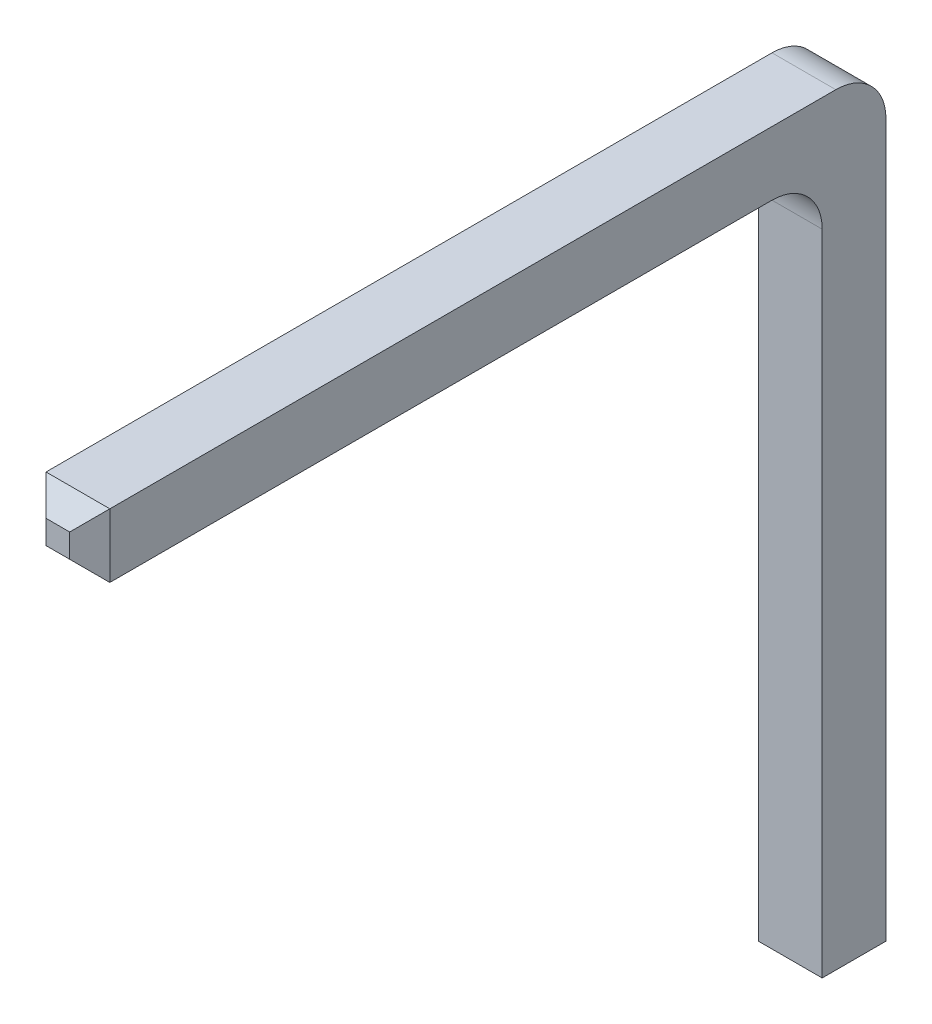
ISO-10303-21;
HEADER;
FILE_DESCRIPTION(('STEP AP214'),'2;1');
FILE_NAME('part.step','',(''),(''),'','','');
FILE_SCHEMA(('AUTOMOTIVE_DESIGN { 1 0 10303 214 1 1 1 1 }'));
ENDSEC;
DATA;
#1=APPLICATION_CONTEXT('core data for automotive mechanical design processes');
#2=APPLICATION_PROTOCOL_DEFINITION('international standard','automotive_design',2000,#1);
#3=PRODUCT_CONTEXT('',#1,'mechanical');
#4=PRODUCT('Part','Part','',(#3));
#5=PRODUCT_RELATED_PRODUCT_CATEGORY('part','',(#4));
#6=PRODUCT_DEFINITION_FORMATION('','',#4);
#7=PRODUCT_DEFINITION_CONTEXT('part definition',#1,'design');
#8=PRODUCT_DEFINITION('design','',#6,#7);
#9=PRODUCT_DEFINITION_SHAPE('','',#8);
#10=(LENGTH_UNIT() NAMED_UNIT(*) SI_UNIT(.MILLI.,.METRE.));
#11=(NAMED_UNIT(*) PLANE_ANGLE_UNIT() SI_UNIT($,.RADIAN.));
#12=(NAMED_UNIT(*) SI_UNIT($,.STERADIAN.) SOLID_ANGLE_UNIT());
#13=UNCERTAINTY_MEASURE_WITH_UNIT(LENGTH_MEASURE(1.E-05),#10,'distance_accuracy_value','');
#14=(GEOMETRIC_REPRESENTATION_CONTEXT(3) GLOBAL_UNCERTAINTY_ASSIGNED_CONTEXT((#13)) GLOBAL_UNIT_ASSIGNED_CONTEXT((#10,
#11,#12)) REPRESENTATION_CONTEXT('',''));
#15=CARTESIAN_POINT('',(0.,0.,0.));
#16=DIRECTION('',(0.,0.,1.));
#17=DIRECTION('',(1.,0.,0.));
#18=AXIS2_PLACEMENT_3D('',#15,#16,#17);
#19=CARTESIAN_POINT('',(0.,7.8,0.636));
#20=DIRECTION('',(0.,0.,-1.));
#21=DIRECTION('',(-1.,0.,0.));
#22=AXIS2_PLACEMENT_3D('',#19,#20,#21);
#23=PLANE('',#22);
#24=DIRECTION('',(0.,-1.,0.));
#25=VECTOR('',#24,1.);
#26=CARTESIAN_POINT('',(0.,7.8,0.636));
#27=LINE('',#26,#25);
#28=CARTESIAN_POINT('',(0.,6.664,0.636));
#29=VERTEX_POINT('',#28);
#30=CARTESIAN_POINT('',(0.,0.200000000000001,0.636));
#31=VERTEX_POINT('',#30);
#32=EDGE_CURVE('E152',#29,#31,#27,.T.);
#33=ORIENTED_EDGE('',*,*,#32,.T.);
#34=DIRECTION('',(1.,0.,0.));
#35=VECTOR('',#34,1.);
#36=CARTESIAN_POINT('',(0.,0.200000000000001,0.636));
#37=LINE('',#36,#35);
#38=CARTESIAN_POINT('',(0.636,0.200000000000001,0.636));
#39=VERTEX_POINT('',#38);
#40=EDGE_CURVE('E11',#31,#39,#37,.T.);
#41=ORIENTED_EDGE('',*,*,#40,.T.);
#42=DIRECTION('',(0.,-1.,0.));
#43=VECTOR('',#42,1.);
#44=CARTESIAN_POINT('',(0.636,7.8,0.636));
#45=LINE('',#44,#43);
#46=CARTESIAN_POINT('',(0.636,6.664,0.636));
#47=VERTEX_POINT('',#46);
#48=EDGE_CURVE('E156',#47,#39,#45,.T.);
#49=ORIENTED_EDGE('',*,*,#48,.F.);
#50=DIRECTION('',(1.,0.,0.));
#51=VECTOR('',#50,1.);
#52=CARTESIAN_POINT('',(0.,6.664,0.636));
#53=LINE('',#52,#51);
#54=EDGE_CURVE('E145',#47,#29,#53,.F.);
#55=ORIENTED_EDGE('',*,*,#54,.T.);
#56=EDGE_LOOP('',(#33,#41,#49,#55));
#57=FACE_BOUND('',#56,.T.);
#58=ADVANCED_FACE('F37',(#57),#23,.F.);
#59=CARTESIAN_POINT('',(0.,7.8,0.));
#60=DIRECTION('',(1.,0.,0.));
#61=DIRECTION('',(0.,0.,-1.));
#62=AXIS2_PLACEMENT_3D('',#59,#60,#61);
#63=PLANE('',#62);
#64=DIRECTION('',(0.,-1.,0.));
#65=VECTOR('',#64,1.);
#66=CARTESIAN_POINT('',(0.,7.8,0.));
#67=LINE('',#66,#65);
#68=CARTESIAN_POINT('',(0.,7.3,0.));
#69=VERTEX_POINT('',#68);
#70=CARTESIAN_POINT('',(0.,0.200000000000001,0.));
#71=VERTEX_POINT('',#70);
#72=EDGE_CURVE('E235',#69,#71,#67,.T.);
#73=ORIENTED_EDGE('',*,*,#72,.T.);
#74=DIRECTION('',(0.,0.,1.));
#75=VECTOR('',#74,1.);
#76=CARTESIAN_POINT('',(0.,0.200000000000001,0.));
#77=LINE('',#76,#75);
#78=EDGE_CURVE('E181',#71,#31,#77,.T.);
#79=ORIENTED_EDGE('',*,*,#78,.T.);
#80=ORIENTED_EDGE('',*,*,#32,.F.);
#81=CARTESIAN_POINT('',(0.,6.664,1.136));
#82=DIRECTION('',(1.,0.,0.));
#83=DIRECTION('',(0.,0.,-1.));
#84=AXIS2_PLACEMENT_3D('',#81,#82,#83);
#85=CIRCLE('',#84,0.5);
#86=CARTESIAN_POINT('',(0.,7.164,1.136));
#87=VERTEX_POINT('',#86);
#88=EDGE_CURVE('E146',#29,#87,#85,.T.);
#89=ORIENTED_EDGE('',*,*,#88,.T.);
#90=DIRECTION('',(0.,0.,-1.));
#91=VECTOR('',#90,1.);
#92=CARTESIAN_POINT('',(0.,7.164,7.936));
#93=LINE('',#92,#91);
#94=CARTESIAN_POINT('',(0.,7.164,7.736));
#95=VERTEX_POINT('',#94);
#96=EDGE_CURVE('E136',#95,#87,#93,.T.);
#97=ORIENTED_EDGE('',*,*,#96,.F.);
#98=DIRECTION('',(0.,1.,0.));
#99=VECTOR('',#98,1.);
#100=CARTESIAN_POINT('',(0.,7.8,7.736));
#101=LINE('',#100,#99);
#102=CARTESIAN_POINT('',(0.,7.8,7.736));
#103=VERTEX_POINT('',#102);
#104=EDGE_CURVE('E175',#95,#103,#101,.T.);
#105=ORIENTED_EDGE('',*,*,#104,.T.);
#106=DIRECTION('',(0.,0.,1.));
#107=VECTOR('',#106,1.);
#108=CARTESIAN_POINT('',(0.,7.8,0.));
#109=LINE('',#108,#107);
#110=CARTESIAN_POINT('',(0.,7.8,0.5));
#111=VERTEX_POINT('',#110);
#112=EDGE_CURVE('E177',#111,#103,#109,.T.);
#113=ORIENTED_EDGE('',*,*,#112,.F.);
#114=CARTESIAN_POINT('',(0.,7.3,0.5));
#115=DIRECTION('',(1.,0.,0.));
#116=DIRECTION('',(0.,0.,-1.));
#117=AXIS2_PLACEMENT_3D('',#114,#115,#116);
#118=CIRCLE('',#117,0.5);
#119=EDGE_CURVE('E435',#111,#69,#118,.F.);
#120=ORIENTED_EDGE('',*,*,#119,.T.);
#121=EDGE_LOOP('',(#73,#79,#80,#89,#97,#105,#113,#120));
#122=FACE_BOUND('',#121,.T.);
#123=ADVANCED_FACE('F233',(#122),#63,.F.);
#124=CARTESIAN_POINT('',(0.636,7.8,0.));
#125=DIRECTION('',(-1.,0.,0.));
#126=DIRECTION('',(0.,0.,1.));
#127=AXIS2_PLACEMENT_3D('',#124,#125,#126);
#128=PLANE('',#127);
#129=ORIENTED_EDGE('',*,*,#48,.T.);
#130=DIRECTION('',(0.,0.,-1.));
#131=VECTOR('',#130,1.);
#132=CARTESIAN_POINT('',(0.636,0.200000000000001,0.));
#133=LINE('',#132,#131);
#134=CARTESIAN_POINT('',(0.636,0.200000000000001,0.));
#135=VERTEX_POINT('',#134);
#136=EDGE_CURVE('E46',#39,#135,#133,.T.);
#137=ORIENTED_EDGE('',*,*,#136,.T.);
#138=DIRECTION('',(0.,-1.,0.));
#139=VECTOR('',#138,1.);
#140=CARTESIAN_POINT('',(0.636,7.8,0.));
#141=LINE('',#140,#139);
#142=CARTESIAN_POINT('',(0.636,7.3,0.));
#143=VERTEX_POINT('',#142);
#144=EDGE_CURVE('E236',#143,#135,#141,.T.);
#145=ORIENTED_EDGE('',*,*,#144,.F.);
#146=CARTESIAN_POINT('',(0.636,7.3,0.5));
#147=DIRECTION('',(-1.,0.,0.));
#148=DIRECTION('',(0.,0.,1.));
#149=AXIS2_PLACEMENT_3D('',#146,#147,#148);
#150=CIRCLE('',#149,0.5);
#151=CARTESIAN_POINT('',(0.636,7.8,0.5));
#152=VERTEX_POINT('',#151);
#153=EDGE_CURVE('E147',#143,#152,#150,.F.);
#154=ORIENTED_EDGE('',*,*,#153,.T.);
#155=DIRECTION('',(0.,0.,-1.));
#156=VECTOR('',#155,1.);
#157=CARTESIAN_POINT('',(0.636,7.8,0.));
#158=LINE('',#157,#156);
#159=CARTESIAN_POINT('',(0.636000000000001,7.8,7.736));
#160=VERTEX_POINT('',#159);
#161=EDGE_CURVE('E238',#160,#152,#158,.T.);
#162=ORIENTED_EDGE('',*,*,#161,.F.);
#163=DIRECTION('',(0.,-1.,0.));
#164=VECTOR('',#163,1.);
#165=CARTESIAN_POINT('',(0.636000000000001,7.164,7.736));
#166=LINE('',#165,#164);
#167=CARTESIAN_POINT('',(0.636,7.164,7.736));
#168=VERTEX_POINT('',#167);
#169=EDGE_CURVE('E133',#160,#168,#166,.T.);
#170=ORIENTED_EDGE('',*,*,#169,.T.);
#171=DIRECTION('',(0.,0.,-1.));
#172=VECTOR('',#171,1.);
#173=CARTESIAN_POINT('',(0.636,7.164,7.936));
#174=LINE('',#173,#172);
#175=CARTESIAN_POINT('',(0.636,7.164,1.136));
#176=VERTEX_POINT('',#175);
#177=EDGE_CURVE('E127',#168,#176,#174,.T.);
#178=ORIENTED_EDGE('',*,*,#177,.T.);
#179=CARTESIAN_POINT('',(0.636,6.664,1.136));
#180=DIRECTION('',(-1.,0.,0.));
#181=DIRECTION('',(0.,0.,1.));
#182=AXIS2_PLACEMENT_3D('',#179,#180,#181);
#183=CIRCLE('',#182,0.5);
#184=EDGE_CURVE('E130',#176,#47,#183,.T.);
#185=ORIENTED_EDGE('',*,*,#184,.T.);
#186=EDGE_LOOP('',(#129,#137,#145,#154,#162,#170,#178,#185));
#187=FACE_BOUND('',#186,.T.);
#188=ADVANCED_FACE('F129',(#187),#128,.F.);
#189=CARTESIAN_POINT('',(0.,7.8,0.));
#190=DIRECTION('',(0.,0.,1.));
#191=DIRECTION('',(1.,0.,0.));
#192=AXIS2_PLACEMENT_3D('',#189,#190,#191);
#193=PLANE('',#192);
#194=ORIENTED_EDGE('',*,*,#144,.T.);
#195=DIRECTION('',(-1.,0.,0.));
#196=VECTOR('',#195,1.);
#197=CARTESIAN_POINT('',(0.,0.200000000000001,0.));
#198=LINE('',#197,#196);
#199=EDGE_CURVE('E202',#135,#71,#198,.T.);
#200=ORIENTED_EDGE('',*,*,#199,.T.);
#201=ORIENTED_EDGE('',*,*,#72,.F.);
#202=DIRECTION('',(-1.,0.,0.));
#203=VECTOR('',#202,1.);
#204=CARTESIAN_POINT('',(0.636,7.3,0.));
#205=LINE('',#204,#203);
#206=EDGE_CURVE('E434',#69,#143,#205,.F.);
#207=ORIENTED_EDGE('',*,*,#206,.T.);
#208=EDGE_LOOP('',(#194,#200,#201,#207));
#209=FACE_BOUND('',#208,.T.);
#210=ADVANCED_FACE('F388',(#209),#193,.F.);
#211=CARTESIAN_POINT('',(0.,7.8,0.));
#212=DIRECTION('',(0.,1.,0.));
#213=DIRECTION('',(0.,0.,1.));
#214=AXIS2_PLACEMENT_3D('',#211,#212,#213);
#215=PLANE('',#214);
#216=ORIENTED_EDGE('',*,*,#112,.T.);
#217=DIRECTION('',(1.,0.,0.));
#218=VECTOR('',#217,1.);
#219=CARTESIAN_POINT('',(0.,7.8,7.736));
#220=LINE('',#219,#218);
#221=EDGE_CURVE('E173',#103,#160,#220,.T.);
#222=ORIENTED_EDGE('',*,*,#221,.T.);
#223=ORIENTED_EDGE('',*,*,#161,.T.);
#224=DIRECTION('',(-1.,0.,0.));
#225=VECTOR('',#224,1.);
#226=CARTESIAN_POINT('',(0.,7.8,0.5));
#227=LINE('',#226,#225);
#228=EDGE_CURVE('E154',#152,#111,#227,.T.);
#229=ORIENTED_EDGE('',*,*,#228,.T.);
#230=EDGE_LOOP('',(#216,#222,#223,#229));
#231=FACE_BOUND('',#230,.T.);
#232=ADVANCED_FACE('F247',(#231),#215,.T.);
#233=CARTESIAN_POINT('',(0.,0.,0.));
#234=DIRECTION('',(0.,1.,0.));
#235=DIRECTION('',(0.,0.,1.));
#236=AXIS2_PLACEMENT_3D('',#233,#234,#235);
#237=PLANE('',#236);
#238=DIRECTION('',(-1.,0.,0.));
#239=VECTOR('',#238,1.);
#240=CARTESIAN_POINT('',(0.,0.,0.435999999999998));
#241=LINE('',#240,#239);
#242=CARTESIAN_POINT('',(0.435999999999998,0.,0.435999999999998));
#243=VERTEX_POINT('',#242);
#244=CARTESIAN_POINT('',(0.200000000000002,0.,0.435999999999998));
#245=VERTEX_POINT('',#244);
#246=EDGE_CURVE('E193',#243,#245,#241,.T.);
#247=ORIENTED_EDGE('',*,*,#246,.T.);
#248=DIRECTION('',(0.,0.,-1.));
#249=VECTOR('',#248,1.);
#250=CARTESIAN_POINT('',(0.200000000000002,0.,0.));
#251=LINE('',#250,#249);
#252=CARTESIAN_POINT('',(0.200000000000002,0.,0.200000000000002));
#253=VERTEX_POINT('',#252);
#254=EDGE_CURVE('E199',#245,#253,#251,.T.);
#255=ORIENTED_EDGE('',*,*,#254,.T.);
#256=DIRECTION('',(1.,0.,0.));
#257=VECTOR('',#256,1.);
#258=CARTESIAN_POINT('',(0.,0.,0.200000000000002));
#259=LINE('',#258,#257);
#260=CARTESIAN_POINT('',(0.435999999999998,0.,0.200000000000002));
#261=VERTEX_POINT('',#260);
#262=EDGE_CURVE('E197',#253,#261,#259,.T.);
#263=ORIENTED_EDGE('',*,*,#262,.T.);
#264=DIRECTION('',(0.,0.,1.));
#265=VECTOR('',#264,1.);
#266=CARTESIAN_POINT('',(0.435999999999998,0.,0.));
#267=LINE('',#266,#265);
#268=EDGE_CURVE('E195',#261,#243,#267,.T.);
#269=ORIENTED_EDGE('',*,*,#268,.T.);
#270=EDGE_LOOP('',(#247,#255,#263,#269));
#271=FACE_BOUND('',#270,.T.);
#272=ADVANCED_FACE('F223',(#271),#237,.F.);
#273=CARTESIAN_POINT('',(0.,7.164,7.936));
#274=DIRECTION('',(0.,1.,0.));
#275=DIRECTION('',(0.,0.,1.));
#276=AXIS2_PLACEMENT_3D('',#273,#274,#275);
#277=PLANE('',#276);
#278=ORIENTED_EDGE('',*,*,#177,.F.);
#279=DIRECTION('',(-1.,0.,0.));
#280=VECTOR('',#279,1.);
#281=CARTESIAN_POINT('',(0.,7.164,7.736));
#282=LINE('',#281,#280);
#283=EDGE_CURVE('E179',#168,#95,#282,.T.);
#284=ORIENTED_EDGE('',*,*,#283,.T.);
#285=ORIENTED_EDGE('',*,*,#96,.T.);
#286=DIRECTION('',(1.,0.,0.));
#287=VECTOR('',#286,1.);
#288=CARTESIAN_POINT('',(0.636,7.164,1.136));
#289=LINE('',#288,#287);
#290=EDGE_CURVE('E144',#87,#176,#289,.T.);
#291=ORIENTED_EDGE('',*,*,#290,.T.);
#292=EDGE_LOOP('',(#278,#284,#285,#291));
#293=FACE_BOUND('',#292,.T.);
#294=ADVANCED_FACE('F149',(#293),#277,.F.);
#295=CARTESIAN_POINT('',(0.,0.,7.936));
#296=DIRECTION('',(0.,0.,1.));
#297=DIRECTION('',(1.,0.,0.));
#298=AXIS2_PLACEMENT_3D('',#295,#296,#297);
#299=PLANE('',#298);
#300=DIRECTION('',(1.,0.,0.));
#301=VECTOR('',#300,1.);
#302=CARTESIAN_POINT('',(0.636,7.364,7.936));
#303=LINE('',#302,#301);
#304=CARTESIAN_POINT('',(0.200000000000001,7.364,7.936));
#305=VERTEX_POINT('',#304);
#306=CARTESIAN_POINT('',(0.436000000000001,7.364,7.936));
#307=VERTEX_POINT('',#306);
#308=EDGE_CURVE('E270',#305,#307,#303,.T.);
#309=ORIENTED_EDGE('',*,*,#308,.T.);
#310=DIRECTION('',(0.,1.,0.));
#311=VECTOR('',#310,1.);
#312=CARTESIAN_POINT('',(0.436000000000001,7.8,7.936));
#313=LINE('',#312,#311);
#314=CARTESIAN_POINT('',(0.436000000000001,7.6,7.936));
#315=VERTEX_POINT('',#314);
#316=EDGE_CURVE('E170',#307,#315,#313,.T.);
#317=ORIENTED_EDGE('',*,*,#316,.T.);
#318=DIRECTION('',(-1.,0.,0.));
#319=VECTOR('',#318,1.);
#320=CARTESIAN_POINT('',(0.,7.6,7.936));
#321=LINE('',#320,#319);
#322=CARTESIAN_POINT('',(0.200000000000001,7.6,7.936));
#323=VERTEX_POINT('',#322);
#324=EDGE_CURVE('E260',#315,#323,#321,.T.);
#325=ORIENTED_EDGE('',*,*,#324,.T.);
#326=DIRECTION('',(0.,-1.,0.));
#327=VECTOR('',#326,1.);
#328=CARTESIAN_POINT('',(0.200000000000001,7.164,7.936));
#329=LINE('',#328,#327);
#330=EDGE_CURVE('E255',#323,#305,#329,.T.);
#331=ORIENTED_EDGE('',*,*,#330,.T.);
#332=EDGE_LOOP('',(#309,#317,#325,#331));
#333=FACE_BOUND('',#332,.T.);
#334=ADVANCED_FACE('F276',(#333),#299,.T.);
#335=CARTESIAN_POINT('',(0.,6.664,1.136));
#336=DIRECTION('',(-1.,0.,0.));
#337=DIRECTION('',(0.,0.,1.));
#338=AXIS2_PLACEMENT_3D('',#335,#336,#337);
#339=CYLINDRICAL_SURFACE('',#338,0.5);
#340=ORIENTED_EDGE('',*,*,#88,.F.);
#341=ORIENTED_EDGE('',*,*,#54,.F.);
#342=ORIENTED_EDGE('',*,*,#184,.F.);
#343=ORIENTED_EDGE('',*,*,#290,.F.);
#344=EDGE_LOOP('',(#340,#341,#342,#343));
#345=FACE_BOUND('',#344,.T.);
#346=ADVANCED_FACE('F143',(#345),#339,.F.);
#347=CARTESIAN_POINT('',(0.,7.3,0.5));
#348=DIRECTION('',(1.,0.,0.));
#349=DIRECTION('',(0.,0.,-1.));
#350=AXIS2_PLACEMENT_3D('',#347,#348,#349);
#351=CYLINDRICAL_SURFACE('',#350,0.5);
#352=ORIENTED_EDGE('',*,*,#153,.F.);
#353=ORIENTED_EDGE('',*,*,#206,.F.);
#354=ORIENTED_EDGE('',*,*,#119,.F.);
#355=ORIENTED_EDGE('',*,*,#228,.F.);
#356=EDGE_LOOP('',(#352,#353,#354,#355));
#357=FACE_BOUND('',#356,.T.);
#358=ADVANCED_FACE('F283',(#357),#351,.T.);
#359=CARTESIAN_POINT('',(0.200000000000001,0.,7.936));
#360=DIRECTION('',(-0.707106781186552,0.,0.707106781186543));
#361=DIRECTION('',(0.,1.,0.));
#362=AXIS2_PLACEMENT_3D('',#359,#360,#361);
#363=PLANE('',#362);
#364=DIRECTION('',(0.577350269189623,-0.577350269189623,0.577350269189631));
#365=VECTOR('',#364,1.);
#366=CARTESIAN_POINT('',(2.73333333333331,5.06666666666669,10.4693333333333));
#367=LINE('',#366,#365);
#368=EDGE_CURVE('E186',#103,#323,#367,.T.);
#369=ORIENTED_EDGE('',*,*,#368,.F.);
#370=ORIENTED_EDGE('',*,*,#104,.F.);
#371=DIRECTION('',(-0.577350269189623,-0.577350269189623,-0.577350269189631));
#372=VECTOR('',#371,1.);
#373=CARTESIAN_POINT('',(0.133333333333335,7.29733333333333,7.86933333333333));
#374=LINE('',#373,#372);
#375=EDGE_CURVE('E137',#305,#95,#374,.T.);
#376=ORIENTED_EDGE('',*,*,#375,.F.);
#377=ORIENTED_EDGE('',*,*,#330,.F.);
#378=EDGE_LOOP('',(#369,#370,#376,#377));
#379=FACE_BOUND('',#378,.T.);
#380=ADVANCED_FACE('F253',(#379),#363,.T.);
#381=CARTESIAN_POINT('',(0.,7.364,7.936));
#382=DIRECTION('',(0.,-0.707106781186552,0.707106781186543));
#383=DIRECTION('',(-1.,0.,0.));
#384=AXIS2_PLACEMENT_3D('',#381,#382,#383);
#385=PLANE('',#384);
#386=ORIENTED_EDGE('',*,*,#375,.T.);
#387=ORIENTED_EDGE('',*,*,#283,.F.);
#388=DIRECTION('',(-0.577350269189623,0.577350269189623,0.577350269189631));
#389=VECTOR('',#388,1.);
#390=CARTESIAN_POINT('',(0.290666666666669,7.50933333333333,8.08133333333334));
#391=LINE('',#390,#389);
#392=EDGE_CURVE('E184',#307,#168,#391,.F.);
#393=ORIENTED_EDGE('',*,*,#392,.F.);
#394=ORIENTED_EDGE('',*,*,#308,.F.);
#395=EDGE_LOOP('',(#386,#387,#393,#394));
#396=FACE_BOUND('',#395,.T.);
#397=ADVANCED_FACE('F269',(#396),#385,.T.);
#398=CARTESIAN_POINT('',(0.,7.6,7.936));
#399=DIRECTION('',(0.,-0.707106781186552,-0.707106781186543));
#400=DIRECTION('',(-1.,0.,0.));
#401=AXIS2_PLACEMENT_3D('',#398,#399,#400);
#402=PLANE('',#401);
#403=ORIENTED_EDGE('',*,*,#368,.T.);
#404=ORIENTED_EDGE('',*,*,#324,.F.);
#405=DIRECTION('',(-0.577350269189623,-0.577350269189623,0.577350269189631));
#406=VECTOR('',#405,1.);
#407=CARTESIAN_POINT('',(0.290666666666669,7.45466666666667,8.08133333333334));
#408=LINE('',#407,#406);
#409=EDGE_CURVE('E182',#160,#315,#408,.T.);
#410=ORIENTED_EDGE('',*,*,#409,.F.);
#411=ORIENTED_EDGE('',*,*,#221,.F.);
#412=EDGE_LOOP('',(#403,#404,#410,#411));
#413=FACE_BOUND('',#412,.T.);
#414=ADVANCED_FACE('F259',(#413),#402,.F.);
#415=CARTESIAN_POINT('',(0.436000000000001,0.,7.936));
#416=DIRECTION('',(0.707106781186552,0.,0.707106781186543));
#417=DIRECTION('',(0.,-1.,0.));
#418=AXIS2_PLACEMENT_3D('',#415,#416,#417);
#419=PLANE('',#418);
#420=ORIENTED_EDGE('',*,*,#392,.T.);
#421=ORIENTED_EDGE('',*,*,#169,.F.);
#422=ORIENTED_EDGE('',*,*,#409,.T.);
#423=ORIENTED_EDGE('',*,*,#316,.F.);
#424=EDGE_LOOP('',(#420,#421,#422,#423));
#425=FACE_BOUND('',#424,.T.);
#426=ADVANCED_FACE('F264',(#425),#419,.T.);
#427=CARTESIAN_POINT('',(0.636,0.200000000000001,0.));
#428=DIRECTION('',(-0.707106781186544,0.707106781186551,0.));
#429=DIRECTION('',(0.,0.,-1.));
#430=AXIS2_PLACEMENT_3D('',#427,#428,#429);
#431=PLANE('',#430);
#432=DIRECTION('',(0.577350269189628,0.577350269189622,0.577350269189627));
#433=VECTOR('',#432,1.);
#434=CARTESIAN_POINT('',(0.423999999999999,-0.0119999999999989,0.423999999999999));
#435=LINE('',#434,#433);
#436=EDGE_CURVE('E208',#243,#39,#435,.T.);
#437=ORIENTED_EDGE('',*,*,#436,.F.);
#438=ORIENTED_EDGE('',*,*,#268,.F.);
#439=DIRECTION('',(0.577350269189627,0.577350269189623,-0.577350269189628));
#440=VECTOR('',#439,1.);
#441=CARTESIAN_POINT('',(0.636,0.200000000000001,0.));
#442=LINE('',#441,#440);
#443=EDGE_CURVE('E41',#135,#261,#442,.F.);
#444=ORIENTED_EDGE('',*,*,#443,.F.);
#445=ORIENTED_EDGE('',*,*,#136,.F.);
#446=EDGE_LOOP('',(#437,#438,#444,#445));
#447=FACE_BOUND('',#446,.T.);
#448=ADVANCED_FACE('F39',(#447),#431,.F.);
#449=CARTESIAN_POINT('',(0.,0.200000000000001,0.));
#450=DIRECTION('',(0.,0.707106781186551,0.707106781186544));
#451=DIRECTION('',(-1.,0.,0.));
#452=AXIS2_PLACEMENT_3D('',#449,#450,#451);
#453=PLANE('',#452);
#454=ORIENTED_EDGE('',*,*,#443,.T.);
#455=ORIENTED_EDGE('',*,*,#262,.F.);
#456=DIRECTION('',(-0.577350269189628,0.577350269189622,-0.577350269189627));
#457=VECTOR('',#456,1.);
#458=CARTESIAN_POINT('',(0.,0.200000000000001,0.));
#459=LINE('',#458,#457);
#460=EDGE_CURVE('E207',#71,#253,#459,.F.);
#461=ORIENTED_EDGE('',*,*,#460,.F.);
#462=ORIENTED_EDGE('',*,*,#199,.F.);
#463=EDGE_LOOP('',(#454,#455,#461,#462));
#464=FACE_BOUND('',#463,.T.);
#465=ADVANCED_FACE('F218',(#464),#453,.F.);
#466=CARTESIAN_POINT('',(0.,0.200000000000001,0.636));
#467=DIRECTION('',(0.,0.707106781186551,-0.707106781186544));
#468=DIRECTION('',(1.,0.,0.));
#469=AXIS2_PLACEMENT_3D('',#466,#467,#468);
#470=PLANE('',#469);
#471=ORIENTED_EDGE('',*,*,#436,.T.);
#472=ORIENTED_EDGE('',*,*,#40,.F.);
#473=DIRECTION('',(0.577350269189627,-0.577350269189623,-0.577350269189628));
#474=VECTOR('',#473,1.);
#475=CARTESIAN_POINT('',(0.,0.200000000000001,0.636));
#476=LINE('',#475,#474);
#477=EDGE_CURVE('E205',#245,#31,#476,.F.);
#478=ORIENTED_EDGE('',*,*,#477,.F.);
#479=ORIENTED_EDGE('',*,*,#246,.F.);
#480=EDGE_LOOP('',(#471,#472,#478,#479));
#481=FACE_BOUND('',#480,.T.);
#482=ADVANCED_FACE('F229',(#481),#470,.F.);
#483=CARTESIAN_POINT('',(0.,0.200000000000001,0.));
#484=DIRECTION('',(0.707106781186544,0.707106781186551,0.));
#485=DIRECTION('',(0.,0.,1.));
#486=AXIS2_PLACEMENT_3D('',#483,#484,#485);
#487=PLANE('',#486);
#488=ORIENTED_EDGE('',*,*,#460,.T.);
#489=ORIENTED_EDGE('',*,*,#254,.F.);
#490=ORIENTED_EDGE('',*,*,#477,.T.);
#491=ORIENTED_EDGE('',*,*,#78,.F.);
#492=EDGE_LOOP('',(#488,#489,#490,#491));
#493=FACE_BOUND('',#492,.T.);
#494=ADVANCED_FACE('F227',(#493),#487,.F.);
#495=CLOSED_SHELL('',(#58,#123,#188,#210,#232,#272,#294,#334,#346,#358,#380,#397,#414,#426,#448,
#465,#482,#494));
#496=MANIFOLD_SOLID_BREP('B2',#495);
#497=ADVANCED_BREP_SHAPE_REPRESENTATION('',(#18,#496),#14);
#498=SHAPE_DEFINITION_REPRESENTATION(#9,#497);
ENDSEC;
END-ISO-10303-21;
